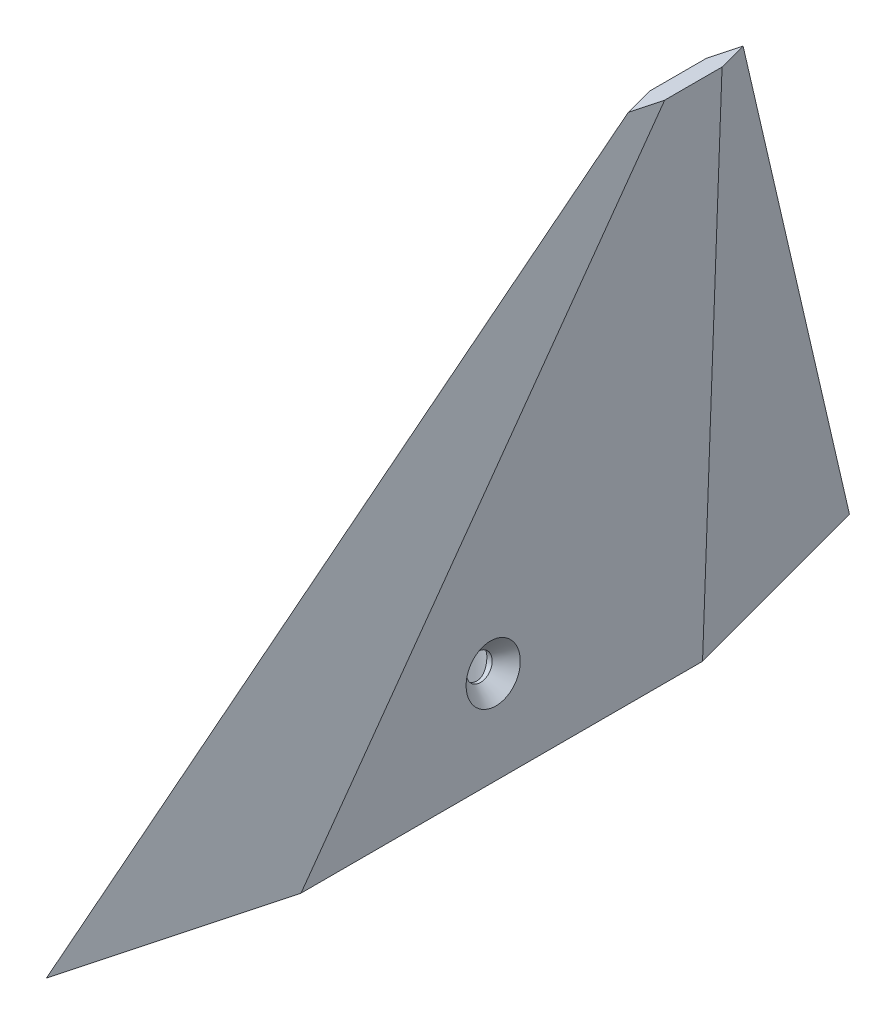
ISO-10303-21;
HEADER;
FILE_DESCRIPTION(('STEP AP214'),'2;1');
FILE_NAME('part.step','',(''),(''),'','','');
FILE_SCHEMA(('AUTOMOTIVE_DESIGN { 1 0 10303 214 1 1 1 1 }'));
ENDSEC;
DATA;
#1=APPLICATION_CONTEXT('core data for automotive mechanical design processes');
#2=APPLICATION_PROTOCOL_DEFINITION('international standard','automotive_design',2000,#1);
#3=PRODUCT_CONTEXT('',#1,'mechanical');
#4=PRODUCT('Part','Part','',(#3));
#5=PRODUCT_RELATED_PRODUCT_CATEGORY('part','',(#4));
#6=PRODUCT_DEFINITION_FORMATION('','',#4);
#7=PRODUCT_DEFINITION_CONTEXT('part definition',#1,'design');
#8=PRODUCT_DEFINITION('design','',#6,#7);
#9=PRODUCT_DEFINITION_SHAPE('','',#8);
#10=(LENGTH_UNIT() NAMED_UNIT(*) SI_UNIT(.MILLI.,.METRE.));
#11=(NAMED_UNIT(*) PLANE_ANGLE_UNIT() SI_UNIT($,.RADIAN.));
#12=(NAMED_UNIT(*) SI_UNIT($,.STERADIAN.) SOLID_ANGLE_UNIT());
#13=UNCERTAINTY_MEASURE_WITH_UNIT(LENGTH_MEASURE(1.E-05),#10,'distance_accuracy_value','');
#14=(GEOMETRIC_REPRESENTATION_CONTEXT(3) GLOBAL_UNCERTAINTY_ASSIGNED_CONTEXT((#13)) GLOBAL_UNIT_ASSIGNED_CONTEXT((#10,
#11,#12)) REPRESENTATION_CONTEXT('',''));
#15=CARTESIAN_POINT('',(0.,0.,0.));
#16=DIRECTION('',(0.,0.,1.));
#17=DIRECTION('',(1.,0.,0.));
#18=AXIS2_PLACEMENT_3D('',#15,#16,#17);
#19=CARTESIAN_POINT('',(0.,20.,-70.));
#20=DIRECTION('',(0.,1.,0.));
#21=DIRECTION('',(0.,0.,1.));
#22=AXIS2_PLACEMENT_3D('',#19,#20,#21);
#23=PLANE('',#22);
#24=CARTESIAN_POINT('',(0.,20.,-70.));
#25=DIRECTION('',(0.,1.,0.));
#26=DIRECTION('',(0.,0.,1.));
#27=AXIS2_PLACEMENT_3D('',#24,#25,#26);
#28=CIRCLE('',#27,5.05);
#29=CARTESIAN_POINT('',(0.,20.,-64.95));
#30=VERTEX_POINT('',#29);
#31=EDGE_CURVE('E22',#30,#30,#28,.F.);
#32=ORIENTED_EDGE('',*,*,#31,.T.);
#33=EDGE_LOOP('',(#32));
#34=FACE_BOUND('',#33,.T.);
#35=ADVANCED_FACE('F19',(#34),#23,.F.);
#36=CARTESIAN_POINT('',(2.90361063953875,14.4249579258095,-70.));
#37=DIRECTION('',(0.99498969745958,0.0999775072168431,0.));
#38=DIRECTION('',(-0.0999775072168431,0.99498969745958,0.));
#39=AXIS2_PLACEMENT_3D('',#36,#37,#38);
#40=CYLINDRICAL_SURFACE('',#39,2.25);
#41=CARTESIAN_POINT('',(4.52106182218293,14.5874809526293,-67.75));
#42=CARTESIAN_POINT('',(4.5210688457898,14.711222096715,-67.7500056475761));
#43=CARTESIAN_POINT('',(4.52615905394233,14.8350194107009,-67.7601560254056));
#44=CARTESIAN_POINT('',(4.54555991379443,15.0787815739717,-67.7998085138221));
#45=CARTESIAN_POINT('',(4.55988248539347,15.1987412580337,-67.8293356426125));
#46=CARTESIAN_POINT('',(4.5955898558596,15.4310432731963,-67.9060041834686));
#47=CARTESIAN_POINT('',(4.61693955458819,15.5434201843891,-67.9530582004132));
#48=CARTESIAN_POINT('',(4.66421918022442,15.7589215106484,-68.0632133247816));
#49=CARTESIAN_POINT('',(4.69014977580094,15.8620445716215,-68.126316775517));
#50=CARTESIAN_POINT('',(4.74625817043075,16.0653594591065,-68.2730938594594));
#51=CARTESIAN_POINT('',(4.77660978796748,16.1645812448373,-68.3580482463821));
#52=CARTESIAN_POINT('',(4.83640784385219,16.3476281544216,-68.543582500153));
#53=CARTESIAN_POINT('',(4.86585377795911,16.431444826174,-68.6441708891595));
#54=CARTESIAN_POINT('',(4.92139877818289,16.5829562774518,-68.8618973841704));
#55=CARTESIAN_POINT('',(4.94738971059083,16.6501701513079,-68.9794005816925));
#56=CARTESIAN_POINT('',(4.99186019782889,16.7622985613542,-69.2257981253947));
#57=CARTESIAN_POINT('',(5.01035568027933,16.807260427922,-69.3546676009177));
#58=CARTESIAN_POINT('',(5.03241774090947,16.8603135841319,-69.5706022330422));
#59=CARTESIAN_POINT('',(5.0389737159951,16.8758851699486,-69.6555875341549));
#60=CARTESIAN_POINT('',(5.0477662464401,16.8967095794458,-69.8270374254423));
#61=CARTESIAN_POINT('',(5.05000336193721,16.9019637412538,-69.9135018223167));
#62=CARTESIAN_POINT('',(5.04999546152978,16.901952855435,-70.1167688090623));
#63=CARTESIAN_POINT('',(5.04590791384723,16.8923630620204,-70.2335991797148));
#64=CARTESIAN_POINT('',(5.02999294591679,16.8545070523786,-70.4636969886369));
#65=CARTESIAN_POINT('',(5.01815793507534,16.8262225196777,-70.576960818397));
#66=CARTESIAN_POINT('',(4.98804571430895,16.7525268131785,-70.7963157852418));
#67=CARTESIAN_POINT('',(4.96979345529977,16.7071819245832,-70.9024328323239));
#68=CARTESIAN_POINT('',(4.92856613526714,16.6011924949452,-71.1056701084215));
#69=CARTESIAN_POINT('',(4.90559046770435,16.5405459887734,-71.2027891796689));
#70=CARTESIAN_POINT('',(4.85526601035895,16.4013312554559,-71.3925376446246));
#71=CARTESIAN_POINT('',(4.8277278157962,16.3218379568,-71.484436387291));
#72=CARTESIAN_POINT('',(4.77204450888816,16.1496179889118,-71.6547309141266));
#73=CARTESIAN_POINT('',(4.74389893891957,16.0568810231931,-71.7331160863206));
#74=CARTESIAN_POINT('',(4.68685289679935,15.8500194523502,-71.8822650019308));
#75=CARTESIAN_POINT('',(4.65816881254305,15.7346778667572,-71.9514331827604));
#76=CARTESIAN_POINT('',(4.60685286838601,15.4929092516184,-72.0696827333515));
#77=CARTESIAN_POINT('',(4.58421560545601,15.3664922533712,-72.1187820562258));
#78=CARTESIAN_POINT('',(4.55185280245007,15.1315340677342,-72.1872978444479));
#79=CARTESIAN_POINT('',(4.54046377969641,15.0243647378292,-72.2106522031936));
#80=CARTESIAN_POINT('',(4.52506933756239,14.8072967568358,-72.2419997368795));
#81=CARTESIAN_POINT('',(4.52105938300783,14.6973998242572,-72.2500023471305));
#82=CARTESIAN_POINT('',(4.52106441455628,14.4706583618991,-72.2499975054523));
#83=CARTESIAN_POINT('',(4.52559924470736,14.3538109897056,-72.2409529346035));
#84=CARTESIAN_POINT('',(4.54332792292385,14.1236004914112,-72.2047821023095));
#85=CARTESIAN_POINT('',(4.55652502353808,14.010238690833,-72.1776490488583));
#86=CARTESIAN_POINT('',(4.5899632528388,13.7905029543171,-72.1062454766109));
#87=CARTESIAN_POINT('',(4.61018722115405,13.6841127385437,-72.062016678147));
#88=CARTESIAN_POINT('',(4.65539914238684,13.480473346232,-71.9577979115416));
#89=CARTESIAN_POINT('',(4.68038859614529,13.3832270639266,-71.89780297576));
#90=CARTESIAN_POINT('',(4.7337093864196,13.1957536387241,-71.7607169292021));
#91=CARTESIAN_POINT('',(4.76213882257942,13.1060160288075,-71.6829955174366));
#92=CARTESIAN_POINT('',(4.81853966201812,12.9401904022967,-71.5139717602945));
#93=CARTESIAN_POINT('',(4.84651088622862,12.8641076115496,-71.4226642397154));
#94=CARTESIAN_POINT('',(4.90102695817271,12.7227274900476,-71.2222451264734));
#95=CARTESIAN_POINT('',(4.92736630165856,12.6584306125668,-71.1123685018902));
#96=CARTESIAN_POINT('',(4.97370046043886,12.548778633825,-70.8823437649854));
#97=CARTESIAN_POINT('',(4.99369957963128,12.5034106765132,-70.7622026910526));
#98=CARTESIAN_POINT('',(5.02261413621195,12.4388463836962,-70.535438161491));
#99=CARTESIAN_POINT('',(5.03281233864198,12.4165707853615,-70.4298460404631));
#100=CARTESIAN_POINT('',(5.04650584837021,12.3867973110165,-70.2161763175487));
#101=CARTESIAN_POINT('',(5.05000229911963,12.3792969140588,-70.1080991428466));
#102=CARTESIAN_POINT('',(5.0499973921066,12.3793018239934,-69.8773830479771));
#103=CARTESIAN_POINT('',(5.04549315803883,12.3889576925939,-69.7547378308944));
#104=CARTESIAN_POINT('',(5.02793063197852,12.427242264426,-69.513051017685));
#105=CARTESIAN_POINT('',(5.0148682021105,12.4558801455118,-69.3940111939043));
#106=CARTESIAN_POINT('',(4.98153687108553,12.5310982590985,-69.1631147175834));
#107=CARTESIAN_POINT('',(4.96128275525255,12.5776416959881,-69.0512438793153));
#108=CARTESIAN_POINT('',(4.91551818156173,12.6873652281646,-68.8371682678449));
#109=CARTESIAN_POINT('',(4.89000681989101,12.7505481845969,-68.7349651611092));
#110=CARTESIAN_POINT('',(4.83519620461533,12.8945767379128,-68.5391517392773));
#111=CARTESIAN_POINT('',(4.80579560332737,12.9759632794316,-68.4459675507173));
#112=CARTESIAN_POINT('',(4.74697534360134,13.1533261250895,-68.2746167595827));
#113=CARTESIAN_POINT('',(4.71755568222315,13.2493081803153,-68.1964561043546));
#114=CARTESIAN_POINT('',(4.66137041585172,13.4561182912732,-68.0557781057146));
#115=CARTESIAN_POINT('',(4.63467646693185,13.5672238772899,-67.9936380421819));
#116=CARTESIAN_POINT('',(4.58820197482769,13.7997514249507,-67.8895047672239));
#117=CARTESIAN_POINT('',(4.56841083218201,13.9211572107195,-67.847480629916));
#118=CARTESIAN_POINT('',(4.54289234091083,14.1338842341196,-67.7942777376531));
#119=CARTESIAN_POINT('',(4.53474310384045,14.2235935688873,-67.7776683938712));
#120=CARTESIAN_POINT('',(4.52382555739226,14.4046854967245,-67.7555280715412));
#121=CARTESIAN_POINT('',(4.52105663353394,14.4960678975113,-67.7499958278858));
#122=CARTESIAN_POINT('',(4.52106182218293,14.5874809526293,-67.75));
#123=B_SPLINE_CURVE_WITH_KNOTS('',3,(#41,#42,#43,#44,#45,#46,#47,#48,#49,#50,#51,#52,#53,#54,
#55,#56,#57,#58,#59,#60,#61,#62,#63,#64,#65,#66,#67,#68,#69,#70,#71,#72,#73,#74,#75,#76,#77,#78,
#79,#80,#81,#82,#83,#84,#85,#86,#87,#88,#89,#90,#91,#92,#93,#94,#95,#96,#97,#98,#99,#100,#101,
#102,#103,#104,#105,#106,#107,#108,#109,#110,#111,#112,#113,#114,#115,#116,#117,#118,#119,#120,
#121,#122),.UNSPECIFIED.,.T.,.F.,(4,2,2,2,2,2,2,2,2,2,2,2,2,2,2,2,2,2,2,2,2,2,2,2,2,2,2,2,2,2,2,
2,2,2,2,2,2,2,2,2,4),(0.,0.37084976032227,0.742179286197476,1.1116814953905,1.48123768508057,
1.88176684823227,2.28251511217943,2.69378206262457,3.10417044119816,3.36344445818436,
3.62268484617198,3.97264818848657,4.32295492234107,4.67191442164606,5.0209187593377,
5.39318402617092,5.76574030796685,6.17633924588454,6.58657006379868,6.9161491458406,
7.2455256008885,7.5955893363905,7.94578459067154,8.29513057239289,8.64458675930697,
9.00924849217218,9.37404948880124,9.76217194701097,10.1500303713264,10.47402744006,
10.7979692235706,11.1654166711726,11.5330419103303,11.8999156869052,12.2668525882216,
12.6466364756717,13.0265703994236,13.4147691423633,13.8023691429502,14.076363554806,
14.3503266721777),.UNSPECIFIED.);
#124=CARTESIAN_POINT('',(4.52106182218293,14.5874809526293,-67.75));
#125=VERTEX_POINT('',#124);
#126=EDGE_CURVE('E105',#125,#125,#123,.T.);
#127=ORIENTED_EDGE('',*,*,#126,.T.);
#128=EDGE_LOOP('',(#127));
#129=FACE_BOUND('',#128,.T.);
#130=CARTESIAN_POINT('',(5.44083436813033,14.6799005692195,-70.));
#131=DIRECTION('',(0.99498969745958,0.0999775072168431,0.));
#132=DIRECTION('',(0.,3.23815048849463E-13,-1.));
#133=AXIS2_PLACEMENT_3D('',#130,#131,#132);
#134=CIRCLE('',#133,2.24999999999681);
#135=CARTESIAN_POINT('',(5.44083436813025,14.6799005692202,-72.2499999999968));
#136=VERTEX_POINT('',#135);
#137=EDGE_CURVE('E106',#136,#136,#134,.T.);
#138=ORIENTED_EDGE('',*,*,#137,.T.);
#139=EDGE_LOOP('',(#138));
#140=FACE_BOUND('',#139,.T.);
#141=ADVANCED_FACE('F119',(#129,#140),#40,.F.);
#142=CARTESIAN_POINT('',(7.87855912682279,14.9248454618923,-70.));
#143=DIRECTION('',(0.99498969745958,0.0999775072168432,0.));
#144=DIRECTION('',(-0.0999775072168432,0.99498969745958,0.));
#145=AXIS2_PLACEMENT_3D('',#142,#143,#144);
#146=CONICAL_SURFACE('',#145,4.69999999983656,0.785398163381872);
#147=ORIENTED_EDGE('',*,*,#137,.F.);
#148=EDGE_LOOP('',(#147));
#149=FACE_BOUND('',#148,.T.);
#150=CARTESIAN_POINT('',(7.87855912693746,14.9248454619039,-70.));
#151=DIRECTION('',(0.99498969745958,0.0999775072168432,0.));
#152=DIRECTION('',(-0.0999775072168432,0.99498969745958,0.));
#153=AXIS2_PLACEMENT_3D('',#150,#151,#152);
#154=CIRCLE('',#153,4.69999999995181);
#155=CARTESIAN_POINT('',(7.40866484302312,19.6012970399159,-70.));
#156=VERTEX_POINT('',#155);
#157=EDGE_CURVE('E103',#156,#156,#154,.T.);
#158=ORIENTED_EDGE('',*,*,#157,.T.);
#159=EDGE_LOOP('',(#158));
#160=FACE_BOUND('',#159,.T.);
#161=ADVANCED_FACE('F126',(#149,#160),#146,.F.);
#162=CARTESIAN_POINT('',(0.,0.,-70.));
#163=DIRECTION('',(0.,1.,0.));
#164=DIRECTION('',(0.,0.,1.));
#165=AXIS2_PLACEMENT_3D('',#162,#163,#164);
#166=CYLINDRICAL_SURFACE('',#165,5.05);
#167=ORIENTED_EDGE('',*,*,#126,.F.);
#168=EDGE_LOOP('',(#167));
#169=FACE_BOUND('',#168,.T.);
#170=ORIENTED_EDGE('',*,*,#31,.F.);
#171=EDGE_LOOP('',(#170));
#172=FACE_BOUND('',#171,.T.);
#173=CARTESIAN_POINT('',(0.,0.,-70.));
#174=DIRECTION('',(0.,1.,0.));
#175=DIRECTION('',(0.,0.,1.));
#176=AXIS2_PLACEMENT_3D('',#173,#174,#175);
#177=CIRCLE('',#176,5.05);
#178=CARTESIAN_POINT('',(0.,0.,-64.95));
#179=VERTEX_POINT('',#178);
#180=EDGE_CURVE('E109',#179,#179,#177,.F.);
#181=ORIENTED_EDGE('',*,*,#180,.T.);
#182=EDGE_LOOP('',(#181));
#183=FACE_BOUND('',#182,.T.);
#184=ADVANCED_FACE('F122',(#169,#172,#183),#166,.F.);
#185=CARTESIAN_POINT('',(0.,80.,-101.442282274311));
#186=DIRECTION('',(-0.917763978694159,-0.311826115815043,-0.245914116933474));
#187=DIRECTION('',(0.321705159693561,-0.946839896828677,0.));
#188=AXIS2_PLACEMENT_3D('',#185,#186,#187);
#189=PLANE('',#188);
#190=DIRECTION('',(0.,-0.61923406116435,0.785206455331275));
#191=VECTOR('',#190,1.);
#192=CARTESIAN_POINT('',(0.,80.,-101.442282274311));
#193=LINE('',#192,#191);
#194=CARTESIAN_POINT('',(0.,80.,-101.442282274311));
#195=VERTEX_POINT('',#194);
#196=CARTESIAN_POINT('',(0.,0.,0.));
#197=VERTEX_POINT('',#196);
#198=EDGE_CURVE('E76',#195,#197,#193,.T.);
#199=ORIENTED_EDGE('',*,*,#198,.T.);
#200=DIRECTION('',(0.258819045102521,0.,-0.965925826289068));
#201=VECTOR('',#200,1.);
#202=CARTESIAN_POINT('',(0.,0.,0.));
#203=LINE('',#202,#201);
#204=CARTESIAN_POINT('',(9.37822173508932,0.,-35.));
#205=VERTEX_POINT('',#204);
#206=EDGE_CURVE('E79',#197,#205,#203,.T.);
#207=ORIENTED_EDGE('',*,*,#206,.T.);
#208=DIRECTION('',(-0.0747365402820964,0.743788174705871,-0.664224059120393));
#209=VECTOR('',#208,1.);
#210=CARTESIAN_POINT('',(9.37822173508929,0.,-35.));
#211=LINE('',#210,#209);
#212=CARTESIAN_POINT('',(1.33974596215561,80.,-106.442282274311));
#213=VERTEX_POINT('',#212);
#214=EDGE_CURVE('E70',#205,#213,#211,.T.);
#215=ORIENTED_EDGE('',*,*,#214,.T.);
#216=DIRECTION('',(0.25881904510252,0.,-0.965925826289069));
#217=VECTOR('',#216,1.);
#218=CARTESIAN_POINT('',(0.,80.,-101.442282274311));
#219=LINE('',#218,#217);
#220=EDGE_CURVE('E80',#195,#213,#219,.T.);
#221=ORIENTED_EDGE('',*,*,#220,.F.);
#222=EDGE_LOOP('',(#199,#207,#215,#221));
#223=FACE_BOUND('',#222,.T.);
#224=ADVANCED_FACE('F78',(#223),#189,.F.);
#225=CARTESIAN_POINT('',(1.33974596215561,80.,-106.442282274311));
#226=DIRECTION('',(-0.99498969745958,-0.0999775072168431,0.));
#227=DIRECTION('',(0.0999775072168431,-0.99498969745958,0.));
#228=AXIS2_PLACEMENT_3D('',#225,#226,#227);
#229=PLANE('',#228);
#230=ORIENTED_EDGE('',*,*,#157,.F.);
#231=EDGE_LOOP('',(#230));
#232=FACE_BOUND('',#231,.T.);
#233=ORIENTED_EDGE('',*,*,#214,.F.);
#234=DIRECTION('',(0.,0.,1.));
#235=VECTOR('',#234,1.);
#236=CARTESIAN_POINT('',(9.37822173508929,0.,-70.));
#237=LINE('',#236,#235);
#238=CARTESIAN_POINT('',(9.37822173508927,0.,-105.));
#239=VERTEX_POINT('',#238);
#240=EDGE_CURVE('E93',#205,#239,#237,.F.);
#241=ORIENTED_EDGE('',*,*,#240,.T.);
#242=DIRECTION('',(-0.0989802239030455,0.985064598801899,-0.140892339974028));
#243=VECTOR('',#242,1.);
#244=CARTESIAN_POINT('',(9.37822173508923,0.,-105.));
#245=LINE('',#244,#243);
#246=CARTESIAN_POINT('',(1.33974596215561,80.,-116.442282274311));
#247=VERTEX_POINT('',#246);
#248=EDGE_CURVE('E86',#239,#247,#245,.T.);
#249=ORIENTED_EDGE('',*,*,#248,.T.);
#250=DIRECTION('',(0.,0.,1.));
#251=VECTOR('',#250,1.);
#252=CARTESIAN_POINT('',(1.33974596215561,80.,-111.442282274311));
#253=LINE('',#252,#251);
#254=EDGE_CURVE('E261',#213,#247,#253,.F.);
#255=ORIENTED_EDGE('',*,*,#254,.F.);
#256=EDGE_LOOP('',(#233,#241,#249,#255));
#257=FACE_BOUND('',#256,.T.);
#258=ADVANCED_FACE('F160',(#232,#257),#229,.F.);
#259=CARTESIAN_POINT('',(1.33974596215561,80.,-116.442282274311));
#260=DIRECTION('',(-0.964189612391014,-0.0599307176650203,0.258353827990649));
#261=DIRECTION('',(0.25881904510252,0.,0.965925826289068));
#262=AXIS2_PLACEMENT_3D('',#259,#260,#261);
#263=PLANE('',#262);
#264=ORIENTED_EDGE('',*,*,#248,.F.);
#265=DIRECTION('',(-0.258819045102521,0.,-0.965925826289068));
#266=VECTOR('',#265,1.);
#267=CARTESIAN_POINT('',(9.37822173508929,0.,-105.));
#268=LINE('',#267,#266);
#269=CARTESIAN_POINT('',(0.,0.,-140.));
#270=VERTEX_POINT('',#269);
#271=EDGE_CURVE('E113',#239,#270,#268,.T.);
#272=ORIENTED_EDGE('',*,*,#271,.T.);
#273=DIRECTION('',(0.,0.974133962376919,0.225971288759973));
#274=VECTOR('',#273,1.);
#275=CARTESIAN_POINT('',(0.,0.,-140.));
#276=LINE('',#275,#274);
#277=CARTESIAN_POINT('',(0.,80.,-121.442282274311));
#278=VERTEX_POINT('',#277);
#279=EDGE_CURVE('E255',#270,#278,#276,.T.);
#280=ORIENTED_EDGE('',*,*,#279,.T.);
#281=DIRECTION('',(-0.25881904510252,0.,-0.965925826289068));
#282=VECTOR('',#281,1.);
#283=CARTESIAN_POINT('',(1.33974596215561,80.,-116.442282274311));
#284=LINE('',#283,#282);
#285=EDGE_CURVE('E250',#247,#278,#284,.T.);
#286=ORIENTED_EDGE('',*,*,#285,.F.);
#287=EDGE_LOOP('',(#264,#272,#280,#286));
#288=FACE_BOUND('',#287,.T.);
#289=ADVANCED_FACE('F158',(#288),#263,.F.);
#290=CARTESIAN_POINT('',(-1.33974596215561,80.,-106.442282274311));
#291=DIRECTION('',(0.917763978694159,-0.311826115815043,-0.245914116933474));
#292=DIRECTION('',(0.321705159693561,0.946839896828677,0.));
#293=AXIS2_PLACEMENT_3D('',#290,#291,#292);
#294=PLANE('',#293);
#295=DIRECTION('',(-0.0747365402820964,-0.743788174705871,0.664224059120393));
#296=VECTOR('',#295,1.);
#297=CARTESIAN_POINT('',(-1.33974596215561,80.,-106.442282274311));
#298=LINE('',#297,#296);
#299=CARTESIAN_POINT('',(-1.33974596215561,80.,-106.442282274311));
#300=VERTEX_POINT('',#299);
#301=CARTESIAN_POINT('',(-9.37822173508931,0.,-35.));
#302=VERTEX_POINT('',#301);
#303=EDGE_CURVE('E97',#300,#302,#298,.T.);
#304=ORIENTED_EDGE('',*,*,#303,.T.);
#305=DIRECTION('',(0.258819045102521,0.,0.965925826289068));
#306=VECTOR('',#305,1.);
#307=CARTESIAN_POINT('',(-9.37822173508929,0.,-35.));
#308=LINE('',#307,#306);
#309=EDGE_CURVE('E85',#302,#197,#308,.T.);
#310=ORIENTED_EDGE('',*,*,#309,.T.);
#311=ORIENTED_EDGE('',*,*,#198,.F.);
#312=DIRECTION('',(0.25881904510252,0.,0.965925826289069));
#313=VECTOR('',#312,1.);
#314=CARTESIAN_POINT('',(-1.33974596215561,80.,-106.442282274311));
#315=LINE('',#314,#313);
#316=EDGE_CURVE('E258',#300,#195,#315,.T.);
#317=ORIENTED_EDGE('',*,*,#316,.F.);
#318=EDGE_LOOP('',(#304,#310,#311,#317));
#319=FACE_BOUND('',#318,.T.);
#320=ADVANCED_FACE('F96',(#319),#294,.F.);
#321=CARTESIAN_POINT('',(0.,0.,-70.));
#322=DIRECTION('',(0.,1.,0.));
#323=DIRECTION('',(0.,0.,1.));
#324=AXIS2_PLACEMENT_3D('',#321,#322,#323);
#325=PLANE('',#324);
#326=ORIENTED_EDGE('',*,*,#180,.F.);
#327=EDGE_LOOP('',(#326));
#328=FACE_BOUND('',#327,.T.);
#329=ORIENTED_EDGE('',*,*,#271,.F.);
#330=ORIENTED_EDGE('',*,*,#240,.F.);
#331=ORIENTED_EDGE('',*,*,#206,.F.);
#332=ORIENTED_EDGE('',*,*,#309,.F.);
#333=DIRECTION('',(0.,0.,1.));
#334=VECTOR('',#333,1.);
#335=CARTESIAN_POINT('',(-9.37822173508929,0.,-116.442282274311));
#336=LINE('',#335,#334);
#337=CARTESIAN_POINT('',(-9.37822173508926,0.,-105.));
#338=VERTEX_POINT('',#337);
#339=EDGE_CURVE('E265',#302,#338,#336,.F.);
#340=ORIENTED_EDGE('',*,*,#339,.T.);
#341=DIRECTION('',(0.25881904510252,0.,-0.965925826289068));
#342=VECTOR('',#341,1.);
#343=CARTESIAN_POINT('',(-4.6394294314222,0.,-122.685413643802));
#344=LINE('',#343,#342);
#345=EDGE_CURVE('E112',#338,#270,#344,.T.);
#346=ORIENTED_EDGE('',*,*,#345,.T.);
#347=EDGE_LOOP('',(#329,#330,#331,#332,#340,#346));
#348=FACE_BOUND('',#347,.T.);
#349=ADVANCED_FACE('F90',(#328,#348),#325,.F.);
#350=CARTESIAN_POINT('',(0.,80.,-121.442282274311));
#351=DIRECTION('',(0.964189612391014,-0.0599307176650203,0.258353827990649));
#352=DIRECTION('',(0.25881904510252,0.,-0.965925826289068));
#353=AXIS2_PLACEMENT_3D('',#350,#351,#352);
#354=PLANE('',#353);
#355=ORIENTED_EDGE('',*,*,#279,.F.);
#356=ORIENTED_EDGE('',*,*,#345,.F.);
#357=DIRECTION('',(0.0989802239030463,0.985064598801899,-0.140892339974028));
#358=VECTOR('',#357,1.);
#359=CARTESIAN_POINT('',(-9.37822173508929,0.,-105.));
#360=LINE('',#359,#358);
#361=CARTESIAN_POINT('',(-1.33974596215561,80.,-116.442282274311));
#362=VERTEX_POINT('',#361);
#363=EDGE_CURVE('E28',#338,#362,#360,.T.);
#364=ORIENTED_EDGE('',*,*,#363,.T.);
#365=DIRECTION('',(-0.25881904510252,0.,0.965925826289069));
#366=VECTOR('',#365,1.);
#367=CARTESIAN_POINT('',(0.,80.,-121.442282274311));
#368=LINE('',#367,#366);
#369=EDGE_CURVE('E36',#278,#362,#368,.T.);
#370=ORIENTED_EDGE('',*,*,#369,.F.);
#371=EDGE_LOOP('',(#355,#356,#364,#370));
#372=FACE_BOUND('',#371,.T.);
#373=ADVANCED_FACE('F146',(#372),#354,.F.);
#374=CARTESIAN_POINT('',(0.,80.,-111.442282274311));
#375=DIRECTION('',(0.,1.,0.));
#376=DIRECTION('',(-1.,0.,0.));
#377=AXIS2_PLACEMENT_3D('',#374,#375,#376);
#378=PLANE('',#377);
#379=ORIENTED_EDGE('',*,*,#254,.T.);
#380=ORIENTED_EDGE('',*,*,#285,.T.);
#381=ORIENTED_EDGE('',*,*,#369,.T.);
#382=DIRECTION('',(0.,0.,1.));
#383=VECTOR('',#382,1.);
#384=CARTESIAN_POINT('',(-1.33974596215561,80.,-116.442282274311));
#385=LINE('',#384,#383);
#386=EDGE_CURVE('E11',#362,#300,#385,.T.);
#387=ORIENTED_EDGE('',*,*,#386,.T.);
#388=ORIENTED_EDGE('',*,*,#316,.T.);
#389=ORIENTED_EDGE('',*,*,#220,.T.);
#390=EDGE_LOOP('',(#379,#380,#381,#387,#388,#389));
#391=FACE_BOUND('',#390,.T.);
#392=ADVANCED_FACE('F140',(#391),#378,.T.);
#393=CARTESIAN_POINT('',(-1.33974596215561,80.,-116.442282274311));
#394=DIRECTION('',(0.99498969745958,-0.0999775072168431,0.));
#395=DIRECTION('',(0.0999775072168431,0.99498969745958,0.));
#396=AXIS2_PLACEMENT_3D('',#393,#394,#395);
#397=PLANE('',#396);
#398=ORIENTED_EDGE('',*,*,#363,.F.);
#399=ORIENTED_EDGE('',*,*,#339,.F.);
#400=ORIENTED_EDGE('',*,*,#303,.F.);
#401=ORIENTED_EDGE('',*,*,#386,.F.);
#402=EDGE_LOOP('',(#398,#399,#400,#401));
#403=FACE_BOUND('',#402,.T.);
#404=ADVANCED_FACE('F138',(#403),#397,.F.);
#405=CLOSED_SHELL('',(#35,#141,#161,#184,#224,#258,#289,#320,#349,#373,#392,#404));
#406=MANIFOLD_SOLID_BREP('B1',#405);
#407=ADVANCED_BREP_SHAPE_REPRESENTATION('',(#18,#406),#14);
#408=SHAPE_DEFINITION_REPRESENTATION(#9,#407);
ENDSEC;
END-ISO-10303-21;
